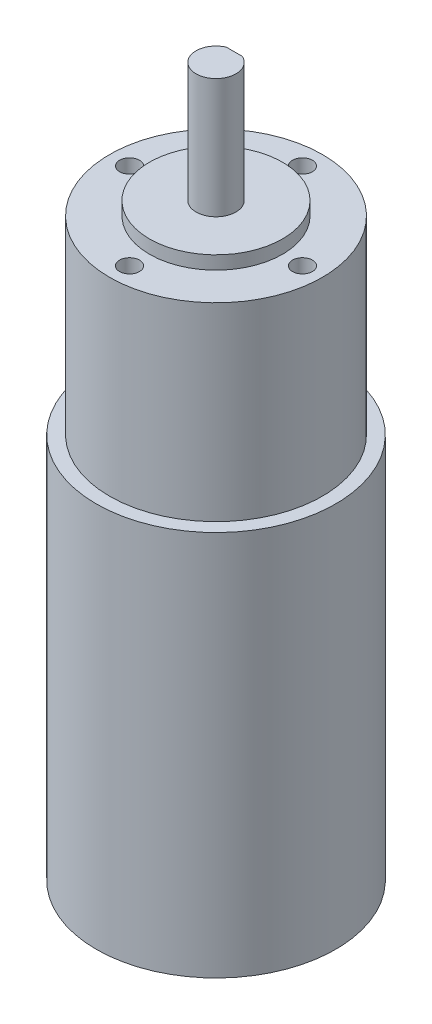
ISO-10303-21;
HEADER;
FILE_DESCRIPTION(('STEP AP214'),'2;1');
FILE_NAME('part.step','',(''),(''),'','','');
FILE_SCHEMA(('AUTOMOTIVE_DESIGN { 1 0 10303 214 1 1 1 1 }'));
ENDSEC;
DATA;
#1=APPLICATION_CONTEXT('core data for automotive mechanical design processes');
#2=APPLICATION_PROTOCOL_DEFINITION('international standard','automotive_design',2000,#1);
#3=PRODUCT_CONTEXT('',#1,'mechanical');
#4=PRODUCT('Part','Part','',(#3));
#5=PRODUCT_RELATED_PRODUCT_CATEGORY('part','',(#4));
#6=PRODUCT_DEFINITION_FORMATION('','',#4);
#7=PRODUCT_DEFINITION_CONTEXT('part definition',#1,'design');
#8=PRODUCT_DEFINITION('design','',#6,#7);
#9=PRODUCT_DEFINITION_SHAPE('','',#8);
#10=(LENGTH_UNIT() NAMED_UNIT(*) SI_UNIT(.MILLI.,.METRE.));
#11=(NAMED_UNIT(*) PLANE_ANGLE_UNIT() SI_UNIT($,.RADIAN.));
#12=(NAMED_UNIT(*) SI_UNIT($,.STERADIAN.) SOLID_ANGLE_UNIT());
#13=UNCERTAINTY_MEASURE_WITH_UNIT(LENGTH_MEASURE(1.E-05),#10,'distance_accuracy_value','');
#14=(GEOMETRIC_REPRESENTATION_CONTEXT(3) GLOBAL_UNCERTAINTY_ASSIGNED_CONTEXT((#13)) GLOBAL_UNIT_ASSIGNED_CONTEXT((#10,
#11,#12)) REPRESENTATION_CONTEXT('',''));
#15=CARTESIAN_POINT('',(0.,0.,0.));
#16=DIRECTION('',(0.,0.,1.));
#17=DIRECTION('',(1.,0.,0.));
#18=AXIS2_PLACEMENT_3D('',#15,#16,#17);
#19=CARTESIAN_POINT('',(0.,86.5,0.));
#20=DIRECTION('',(0.,1.,0.));
#21=DIRECTION('',(0.,0.,1.));
#22=AXIS2_PLACEMENT_3D('',#19,#20,#21);
#23=PLANE('',#22);
#24=CARTESIAN_POINT('',(0.,86.5,0.));
#25=DIRECTION('',(0.,1.,0.));
#26=DIRECTION('',(0.,0.,1.));
#27=AXIS2_PLACEMENT_3D('',#24,#25,#26);
#28=CIRCLE('',#27,10.);
#29=CARTESIAN_POINT('',(0.,86.5,10.));
#30=VERTEX_POINT('',#29);
#31=EDGE_CURVE('E49',#30,#30,#28,.T.);
#32=ORIENTED_EDGE('',*,*,#31,.F.);
#33=EDGE_LOOP('',(#32));
#34=FACE_BOUND('',#33,.T.);
#35=CARTESIAN_POINT('',(13.,86.5,0.));
#36=DIRECTION('',(0.,1.,0.));
#37=DIRECTION('',(0.,0.,1.));
#38=AXIS2_PLACEMENT_3D('',#35,#36,#37);
#39=CIRCLE('',#38,1.5);
#40=CARTESIAN_POINT('',(13.,86.5,1.5));
#41=VERTEX_POINT('',#40);
#42=EDGE_CURVE('E186',#41,#41,#39,.T.);
#43=ORIENTED_EDGE('',*,*,#42,.F.);
#44=EDGE_LOOP('',(#43));
#45=FACE_BOUND('',#44,.T.);
#46=CARTESIAN_POINT('',(1.36167772214882E-13,86.5,13.));
#47=DIRECTION('',(0.,1.,0.));
#48=DIRECTION('',(-1.,0.,0.));
#49=AXIS2_PLACEMENT_3D('',#46,#47,#48);
#50=CIRCLE('',#49,1.5);
#51=CARTESIAN_POINT('',(-1.49999999999986,86.5,13.));
#52=VERTEX_POINT('',#51);
#53=EDGE_CURVE('E174',#52,#52,#50,.T.);
#54=ORIENTED_EDGE('',*,*,#53,.F.);
#55=EDGE_LOOP('',(#54));
#56=FACE_BOUND('',#55,.T.);
#57=CARTESIAN_POINT('',(-13.,86.5,0.));
#58=DIRECTION('',(0.,1.,0.));
#59=DIRECTION('',(0.,0.,-1.));
#60=AXIS2_PLACEMENT_3D('',#57,#58,#59);
#61=CIRCLE('',#60,1.5);
#62=CARTESIAN_POINT('',(-13.,86.5,-1.5));
#63=VERTEX_POINT('',#62);
#64=EDGE_CURVE('E193',#63,#63,#61,.T.);
#65=ORIENTED_EDGE('',*,*,#64,.F.);
#66=EDGE_LOOP('',(#65));
#67=FACE_BOUND('',#66,.T.);
#68=CARTESIAN_POINT('',(0.,86.5,-13.));
#69=DIRECTION('',(0.,1.,0.));
#70=DIRECTION('',(1.,0.,0.));
#71=AXIS2_PLACEMENT_3D('',#68,#69,#70);
#72=CIRCLE('',#71,1.5);
#73=CARTESIAN_POINT('',(1.49999999999995,86.5,-13.));
#74=VERTEX_POINT('',#73);
#75=EDGE_CURVE('E187',#74,#74,#72,.T.);
#76=ORIENTED_EDGE('',*,*,#75,.F.);
#77=EDGE_LOOP('',(#76));
#78=FACE_BOUND('',#77,.T.);
#79=CARTESIAN_POINT('',(0.,86.5,0.));
#80=DIRECTION('',(0.,1.,0.));
#81=DIRECTION('',(0.,0.,1.));
#82=AXIS2_PLACEMENT_3D('',#79,#80,#81);
#83=CIRCLE('',#82,16.);
#84=CARTESIAN_POINT('',(0.,86.5,16.));
#85=VERTEX_POINT('',#84);
#86=EDGE_CURVE('E179',#85,#85,#83,.T.);
#87=ORIENTED_EDGE('',*,*,#86,.T.);
#88=EDGE_LOOP('',(#87));
#89=FACE_BOUND('',#88,.T.);
#90=ADVANCED_FACE('F40',(#34,#45,#56,#67,#78,#89),#23,.T.);
#91=CARTESIAN_POINT('',(0.,88.5,0.));
#92=DIRECTION('',(0.,-1.,0.));
#93=DIRECTION('',(0.,0.,-1.));
#94=AXIS2_PLACEMENT_3D('',#91,#92,#93);
#95=CYLINDRICAL_SURFACE('',#94,10.);
#96=CARTESIAN_POINT('',(0.,88.5,0.));
#97=DIRECTION('',(0.,1.,0.));
#98=DIRECTION('',(0.,0.,1.));
#99=AXIS2_PLACEMENT_3D('',#96,#97,#98);
#100=CIRCLE('',#99,10.);
#101=CARTESIAN_POINT('',(0.,88.5,10.));
#102=VERTEX_POINT('',#101);
#103=EDGE_CURVE('E83',#102,#102,#100,.T.);
#104=ORIENTED_EDGE('',*,*,#103,.F.);
#105=EDGE_LOOP('',(#104));
#106=FACE_BOUND('',#105,.T.);
#107=ORIENTED_EDGE('',*,*,#31,.T.);
#108=EDGE_LOOP('',(#107));
#109=FACE_BOUND('',#108,.T.);
#110=ADVANCED_FACE('F108',(#106,#109),#95,.T.);
#111=CARTESIAN_POINT('',(0.,88.5,0.));
#112=DIRECTION('',(0.,1.,0.));
#113=DIRECTION('',(0.,0.,1.));
#114=AXIS2_PLACEMENT_3D('',#111,#112,#113);
#115=PLANE('',#114);
#116=CARTESIAN_POINT('',(0.,88.5,0.));
#117=DIRECTION('',(0.,1.,0.));
#118=DIRECTION('',(0.,0.,1.));
#119=AXIS2_PLACEMENT_3D('',#116,#117,#118);
#120=CIRCLE('',#119,3.);
#121=CARTESIAN_POINT('',(0.,88.5,3.));
#122=VERTEX_POINT('',#121);
#123=EDGE_CURVE('E12',#122,#122,#120,.T.);
#124=ORIENTED_EDGE('',*,*,#123,.F.);
#125=EDGE_LOOP('',(#124));
#126=FACE_BOUND('',#125,.T.);
#127=ORIENTED_EDGE('',*,*,#103,.T.);
#128=EDGE_LOOP('',(#127));
#129=FACE_BOUND('',#128,.T.);
#130=ADVANCED_FACE('F113',(#126,#129),#115,.T.);
#131=CARTESIAN_POINT('',(0.,106.5,0.));
#132=DIRECTION('',(0.,-1.,0.));
#133=DIRECTION('',(0.,0.,-1.));
#134=AXIS2_PLACEMENT_3D('',#131,#132,#133);
#135=CYLINDRICAL_SURFACE('',#134,3.);
#136=CARTESIAN_POINT('',(0.,106.5,0.));
#137=DIRECTION('',(0.,1.,0.));
#138=DIRECTION('',(0.,0.,1.));
#139=AXIS2_PLACEMENT_3D('',#136,#137,#138);
#140=CIRCLE('',#139,3.);
#141=CARTESIAN_POINT('',(-1.19895788082818,106.5,-2.75));
#142=VERTEX_POINT('',#141);
#143=CARTESIAN_POINT('',(1.19895788082818,106.5,-2.75));
#144=VERTEX_POINT('',#143);
#145=EDGE_CURVE('E80',#142,#144,#140,.T.);
#146=ORIENTED_EDGE('',*,*,#145,.F.);
#147=DIRECTION('',(0.,1.,0.));
#148=VECTOR('',#147,1.);
#149=CARTESIAN_POINT('',(-1.19895788082818,91.5,-2.75));
#150=LINE('',#149,#148);
#151=CARTESIAN_POINT('',(-1.19895788082818,91.5,-2.75));
#152=VERTEX_POINT('',#151);
#153=EDGE_CURVE('E57',#152,#142,#150,.T.);
#154=ORIENTED_EDGE('',*,*,#153,.F.);
#155=CARTESIAN_POINT('',(0.,91.5,0.));
#156=DIRECTION('',(0.,1.,0.));
#157=DIRECTION('',(0.,0.,1.));
#158=AXIS2_PLACEMENT_3D('',#155,#156,#157);
#159=CIRCLE('',#158,3.);
#160=CARTESIAN_POINT('',(1.19895788082818,91.5,-2.75));
#161=VERTEX_POINT('',#160);
#162=EDGE_CURVE('E73',#161,#152,#159,.T.);
#163=ORIENTED_EDGE('',*,*,#162,.F.);
#164=DIRECTION('',(0.,1.,0.));
#165=VECTOR('',#164,1.);
#166=CARTESIAN_POINT('',(1.19895788082818,91.5,-2.75));
#167=LINE('',#166,#165);
#168=EDGE_CURVE('E63',#161,#144,#167,.T.);
#169=ORIENTED_EDGE('',*,*,#168,.T.);
#170=EDGE_LOOP('',(#146,#154,#163,#169));
#171=FACE_BOUND('',#170,.T.);
#172=ORIENTED_EDGE('',*,*,#123,.T.);
#173=EDGE_LOOP('',(#172));
#174=FACE_BOUND('',#173,.T.);
#175=ADVANCED_FACE('F78',(#171,#174),#135,.T.);
#176=CARTESIAN_POINT('',(0.,106.5,0.));
#177=DIRECTION('',(0.,1.,0.));
#178=DIRECTION('',(0.,0.,1.));
#179=AXIS2_PLACEMENT_3D('',#176,#177,#178);
#180=PLANE('',#179);
#181=DIRECTION('',(1.,0.,0.));
#182=VECTOR('',#181,1.);
#183=CARTESIAN_POINT('',(0.,106.5,-2.75));
#184=LINE('',#183,#182);
#185=EDGE_CURVE('E68',#142,#144,#184,.T.);
#186=ORIENTED_EDGE('',*,*,#185,.F.);
#187=ORIENTED_EDGE('',*,*,#145,.T.);
#188=EDGE_LOOP('',(#186,#187));
#189=FACE_BOUND('',#188,.T.);
#190=ADVANCED_FACE('F82',(#189),#180,.T.);
#191=CARTESIAN_POINT('',(0.,91.5,-2.75));
#192=DIRECTION('',(0.,0.,1.));
#193=DIRECTION('',(1.,0.,0.));
#194=AXIS2_PLACEMENT_3D('',#191,#192,#193);
#195=PLANE('',#194);
#196=ORIENTED_EDGE('',*,*,#185,.T.);
#197=ORIENTED_EDGE('',*,*,#168,.F.);
#198=DIRECTION('',(1.,0.,0.));
#199=VECTOR('',#198,1.);
#200=CARTESIAN_POINT('',(0.,91.5,-2.75));
#201=LINE('',#200,#199);
#202=EDGE_CURVE('E203',#152,#161,#201,.T.);
#203=ORIENTED_EDGE('',*,*,#202,.F.);
#204=ORIENTED_EDGE('',*,*,#153,.T.);
#205=EDGE_LOOP('',(#196,#197,#203,#204));
#206=FACE_BOUND('',#205,.T.);
#207=ADVANCED_FACE('F69',(#206),#195,.F.);
#208=CARTESIAN_POINT('',(0.,91.5,0.));
#209=DIRECTION('',(0.,1.,0.));
#210=DIRECTION('',(0.,0.,1.));
#211=AXIS2_PLACEMENT_3D('',#208,#209,#210);
#212=PLANE('',#211);
#213=ORIENTED_EDGE('',*,*,#162,.T.);
#214=ORIENTED_EDGE('',*,*,#202,.T.);
#215=EDGE_LOOP('',(#213,#214));
#216=FACE_BOUND('',#215,.T.);
#217=ADVANCED_FACE('F127',(#216),#212,.T.);
#218=CARTESIAN_POINT('',(13.,76.5,0.));
#219=DIRECTION('',(0.,1.,0.));
#220=DIRECTION('',(0.,0.,1.));
#221=AXIS2_PLACEMENT_3D('',#218,#219,#220);
#222=CYLINDRICAL_SURFACE('',#221,1.5);
#223=CARTESIAN_POINT('',(13.,76.5,0.));
#224=DIRECTION('',(0.,1.,0.));
#225=DIRECTION('',(0.,0.,1.));
#226=AXIS2_PLACEMENT_3D('',#223,#224,#225);
#227=CIRCLE('',#226,1.5);
#228=CARTESIAN_POINT('',(13.,76.5,1.5));
#229=VERTEX_POINT('',#228);
#230=EDGE_CURVE('E74',#229,#229,#227,.T.);
#231=ORIENTED_EDGE('',*,*,#230,.F.);
#232=EDGE_LOOP('',(#231));
#233=FACE_BOUND('',#232,.T.);
#234=ORIENTED_EDGE('',*,*,#42,.T.);
#235=EDGE_LOOP('',(#234));
#236=FACE_BOUND('',#235,.T.);
#237=ADVANCED_FACE('F130',(#233,#236),#222,.F.);
#238=CARTESIAN_POINT('',(13.,76.5,0.));
#239=DIRECTION('',(0.,1.,0.));
#240=DIRECTION('',(0.,0.,1.));
#241=AXIS2_PLACEMENT_3D('',#238,#239,#240);
#242=PLANE('',#241);
#243=ORIENTED_EDGE('',*,*,#230,.T.);
#244=EDGE_LOOP('',(#243));
#245=FACE_BOUND('',#244,.T.);
#246=ADVANCED_FACE('F134',(#245),#242,.T.);
#247=CARTESIAN_POINT('',(1.36167772214882E-13,76.5,13.));
#248=DIRECTION('',(0.,1.,0.));
#249=DIRECTION('',(0.,0.,1.));
#250=AXIS2_PLACEMENT_3D('',#247,#248,#249);
#251=CYLINDRICAL_SURFACE('',#250,1.5);
#252=CARTESIAN_POINT('',(1.36167772214882E-13,76.5,13.));
#253=DIRECTION('',(0.,1.,0.));
#254=DIRECTION('',(-1.,0.,0.));
#255=AXIS2_PLACEMENT_3D('',#252,#253,#254);
#256=CIRCLE('',#255,1.5);
#257=CARTESIAN_POINT('',(-1.49999999999986,76.5,13.));
#258=VERTEX_POINT('',#257);
#259=EDGE_CURVE('E177',#258,#258,#256,.T.);
#260=ORIENTED_EDGE('',*,*,#259,.F.);
#261=EDGE_LOOP('',(#260));
#262=FACE_BOUND('',#261,.T.);
#263=ORIENTED_EDGE('',*,*,#53,.T.);
#264=EDGE_LOOP('',(#263));
#265=FACE_BOUND('',#264,.T.);
#266=ADVANCED_FACE('F138',(#262,#265),#251,.F.);
#267=CARTESIAN_POINT('',(1.36167772214882E-13,76.5,13.));
#268=DIRECTION('',(0.,1.,0.));
#269=DIRECTION('',(-1.,0.,0.));
#270=AXIS2_PLACEMENT_3D('',#267,#268,#269);
#271=PLANE('',#270);
#272=ORIENTED_EDGE('',*,*,#259,.T.);
#273=EDGE_LOOP('',(#272));
#274=FACE_BOUND('',#273,.T.);
#275=ADVANCED_FACE('F142',(#274),#271,.T.);
#276=CARTESIAN_POINT('',(-13.,76.5,0.));
#277=DIRECTION('',(0.,1.,0.));
#278=DIRECTION('',(0.,0.,1.));
#279=AXIS2_PLACEMENT_3D('',#276,#277,#278);
#280=CYLINDRICAL_SURFACE('',#279,1.5);
#281=CARTESIAN_POINT('',(-13.,76.5,0.));
#282=DIRECTION('',(0.,1.,0.));
#283=DIRECTION('',(0.,0.,-1.));
#284=AXIS2_PLACEMENT_3D('',#281,#282,#283);
#285=CIRCLE('',#284,1.5);
#286=CARTESIAN_POINT('',(-13.,76.5,-1.5));
#287=VERTEX_POINT('',#286);
#288=EDGE_CURVE('E190',#287,#287,#285,.T.);
#289=ORIENTED_EDGE('',*,*,#288,.F.);
#290=EDGE_LOOP('',(#289));
#291=FACE_BOUND('',#290,.T.);
#292=ORIENTED_EDGE('',*,*,#64,.T.);
#293=EDGE_LOOP('',(#292));
#294=FACE_BOUND('',#293,.T.);
#295=ADVANCED_FACE('F146',(#291,#294),#280,.F.);
#296=CARTESIAN_POINT('',(-13.,76.5,0.));
#297=DIRECTION('',(0.,1.,0.));
#298=DIRECTION('',(0.,0.,-1.));
#299=AXIS2_PLACEMENT_3D('',#296,#297,#298);
#300=PLANE('',#299);
#301=ORIENTED_EDGE('',*,*,#288,.T.);
#302=EDGE_LOOP('',(#301));
#303=FACE_BOUND('',#302,.T.);
#304=ADVANCED_FACE('F150',(#303),#300,.T.);
#305=CARTESIAN_POINT('',(0.,76.5,-13.));
#306=DIRECTION('',(0.,1.,0.));
#307=DIRECTION('',(0.,0.,1.));
#308=AXIS2_PLACEMENT_3D('',#305,#306,#307);
#309=CYLINDRICAL_SURFACE('',#308,1.5);
#310=CARTESIAN_POINT('',(0.,76.5,-13.));
#311=DIRECTION('',(0.,1.,0.));
#312=DIRECTION('',(1.,0.,0.));
#313=AXIS2_PLACEMENT_3D('',#310,#311,#312);
#314=CIRCLE('',#313,1.5);
#315=CARTESIAN_POINT('',(1.49999999999995,76.5,-13.));
#316=VERTEX_POINT('',#315);
#317=EDGE_CURVE('E183',#316,#316,#314,.T.);
#318=ORIENTED_EDGE('',*,*,#317,.F.);
#319=EDGE_LOOP('',(#318));
#320=FACE_BOUND('',#319,.T.);
#321=ORIENTED_EDGE('',*,*,#75,.T.);
#322=EDGE_LOOP('',(#321));
#323=FACE_BOUND('',#322,.T.);
#324=ADVANCED_FACE('F154',(#320,#323),#309,.F.);
#325=CARTESIAN_POINT('',(0.,76.5,-13.));
#326=DIRECTION('',(0.,1.,0.));
#327=DIRECTION('',(1.,0.,0.));
#328=AXIS2_PLACEMENT_3D('',#325,#326,#327);
#329=PLANE('',#328);
#330=ORIENTED_EDGE('',*,*,#317,.T.);
#331=EDGE_LOOP('',(#330));
#332=FACE_BOUND('',#331,.T.);
#333=ADVANCED_FACE('F158',(#332),#329,.T.);
#334=CARTESIAN_POINT('',(0.,58.,0.));
#335=DIRECTION('',(0.,1.,0.));
#336=DIRECTION('',(0.,0.,1.));
#337=AXIS2_PLACEMENT_3D('',#334,#335,#336);
#338=PLANE('',#337);
#339=CARTESIAN_POINT('',(0.,58.,0.));
#340=DIRECTION('',(0.,1.,0.));
#341=DIRECTION('',(0.,0.,1.));
#342=AXIS2_PLACEMENT_3D('',#339,#340,#341);
#343=CIRCLE('',#342,16.);
#344=CARTESIAN_POINT('',(0.,58.,16.));
#345=VERTEX_POINT('',#344);
#346=EDGE_CURVE('E170',#345,#345,#343,.T.);
#347=ORIENTED_EDGE('',*,*,#346,.F.);
#348=EDGE_LOOP('',(#347));
#349=FACE_BOUND('',#348,.T.);
#350=CARTESIAN_POINT('',(0.,58.,0.));
#351=DIRECTION('',(0.,1.,0.));
#352=DIRECTION('',(0.,0.,1.));
#353=AXIS2_PLACEMENT_3D('',#350,#351,#352);
#354=CIRCLE('',#353,18.);
#355=CARTESIAN_POINT('',(0.,58.,18.));
#356=VERTEX_POINT('',#355);
#357=EDGE_CURVE('E173',#356,#356,#354,.T.);
#358=ORIENTED_EDGE('',*,*,#357,.T.);
#359=EDGE_LOOP('',(#358));
#360=FACE_BOUND('',#359,.T.);
#361=ADVANCED_FACE('F103',(#349,#360),#338,.T.);
#362=CARTESIAN_POINT('',(0.,58.,0.));
#363=DIRECTION('',(0.,1.,0.));
#364=DIRECTION('',(0.,0.,1.));
#365=AXIS2_PLACEMENT_3D('',#362,#363,#364);
#366=CYLINDRICAL_SURFACE('',#365,16.);
#367=ORIENTED_EDGE('',*,*,#346,.T.);
#368=EDGE_LOOP('',(#367));
#369=FACE_BOUND('',#368,.T.);
#370=ORIENTED_EDGE('',*,*,#86,.F.);
#371=EDGE_LOOP('',(#370));
#372=FACE_BOUND('',#371,.T.);
#373=ADVANCED_FACE('F98',(#369,#372),#366,.T.);
#374=CARTESIAN_POINT('',(0.,0.,0.));
#375=DIRECTION('',(0.,1.,0.));
#376=DIRECTION('',(0.,0.,1.));
#377=AXIS2_PLACEMENT_3D('',#374,#375,#376);
#378=PLANE('',#377);
#379=CARTESIAN_POINT('',(0.,0.,0.));
#380=DIRECTION('',(0.,1.,0.));
#381=DIRECTION('',(0.,0.,1.));
#382=AXIS2_PLACEMENT_3D('',#379,#380,#381);
#383=CIRCLE('',#382,18.);
#384=CARTESIAN_POINT('',(0.,0.,18.));
#385=VERTEX_POINT('',#384);
#386=EDGE_CURVE('E44',#385,#385,#383,.T.);
#387=ORIENTED_EDGE('',*,*,#386,.F.);
#388=EDGE_LOOP('',(#387));
#389=FACE_BOUND('',#388,.T.);
#390=ADVANCED_FACE('F96',(#389),#378,.F.);
#391=CARTESIAN_POINT('',(0.,86.5,0.));
#392=DIRECTION('',(0.,-1.,0.));
#393=DIRECTION('',(0.,0.,-1.));
#394=AXIS2_PLACEMENT_3D('',#391,#392,#393);
#395=CYLINDRICAL_SURFACE('',#394,18.);
#396=ORIENTED_EDGE('',*,*,#386,.T.);
#397=EDGE_LOOP('',(#396));
#398=FACE_BOUND('',#397,.T.);
#399=ORIENTED_EDGE('',*,*,#357,.F.);
#400=EDGE_LOOP('',(#399));
#401=FACE_BOUND('',#400,.T.);
#402=ADVANCED_FACE('F42',(#398,#401),#395,.T.);
#403=CLOSED_SHELL('',(#90,#110,#130,#175,#190,#207,#217,#237,#246,#266,#275,#295,#304,#324,#333,
#361,#373,#390,#402));
#404=MANIFOLD_SOLID_BREP('B2',#403);
#405=ADVANCED_BREP_SHAPE_REPRESENTATION('',(#18,#404),#14);
#406=SHAPE_DEFINITION_REPRESENTATION(#9,#405);
ENDSEC;
END-ISO-10303-21;
